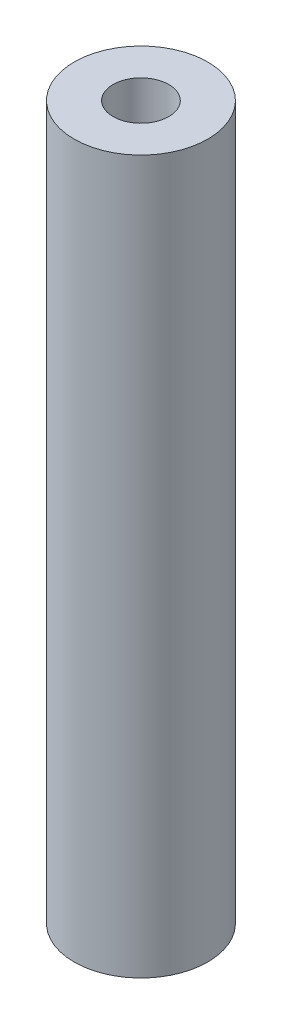
ISO-10303-21;
HEADER;
FILE_DESCRIPTION(('STEP AP214'),'2;1');
FILE_NAME('part.step','',(''),(''),'','','');
FILE_SCHEMA(('AUTOMOTIVE_DESIGN { 1 0 10303 214 1 1 1 1 }'));
ENDSEC;
DATA;
#1=APPLICATION_CONTEXT('core data for automotive mechanical design processes');
#2=APPLICATION_PROTOCOL_DEFINITION('international standard','automotive_design',2000,#1);
#3=PRODUCT_CONTEXT('',#1,'mechanical');
#4=PRODUCT('Part','Part','',(#3));
#5=PRODUCT_RELATED_PRODUCT_CATEGORY('part','',(#4));
#6=PRODUCT_DEFINITION_FORMATION('','',#4);
#7=PRODUCT_DEFINITION_CONTEXT('part definition',#1,'design');
#8=PRODUCT_DEFINITION('design','',#6,#7);
#9=PRODUCT_DEFINITION_SHAPE('','',#8);
#10=(LENGTH_UNIT() NAMED_UNIT(*) SI_UNIT(.MILLI.,.METRE.));
#11=(NAMED_UNIT(*) PLANE_ANGLE_UNIT() SI_UNIT($,.RADIAN.));
#12=(NAMED_UNIT(*) SI_UNIT($,.STERADIAN.) SOLID_ANGLE_UNIT());
#13=UNCERTAINTY_MEASURE_WITH_UNIT(LENGTH_MEASURE(1.E-05),#10,'distance_accuracy_value','');
#14=(GEOMETRIC_REPRESENTATION_CONTEXT(3) GLOBAL_UNCERTAINTY_ASSIGNED_CONTEXT((#13)) GLOBAL_UNIT_ASSIGNED_CONTEXT((#10,
#11,#12)) REPRESENTATION_CONTEXT('',''));
#15=CARTESIAN_POINT('',(0.,0.,0.));
#16=DIRECTION('',(0.,0.,1.));
#17=DIRECTION('',(1.,0.,0.));
#18=AXIS2_PLACEMENT_3D('',#15,#16,#17);
#19=CARTESIAN_POINT('',(0.,32.,0.));
#20=DIRECTION('',(0.,-1.,0.));
#21=DIRECTION('',(0.,0.,-1.));
#22=AXIS2_PLACEMENT_3D('',#19,#20,#21);
#23=CYLINDRICAL_SURFACE('',#22,3.);
#24=CARTESIAN_POINT('',(0.,32.,0.));
#25=DIRECTION('',(0.,1.,0.));
#26=DIRECTION('',(0.,0.,1.));
#27=AXIS2_PLACEMENT_3D('',#24,#25,#26);
#28=CIRCLE('',#27,3.);
#29=CARTESIAN_POINT('',(0.,32.,3.));
#30=VERTEX_POINT('',#29);
#31=EDGE_CURVE('E11',#30,#30,#28,.T.);
#32=ORIENTED_EDGE('',*,*,#31,.F.);
#33=EDGE_LOOP('',(#32));
#34=FACE_BOUND('',#33,.T.);
#35=CARTESIAN_POINT('',(0.,0.,0.));
#36=DIRECTION('',(0.,1.,0.));
#37=DIRECTION('',(0.,0.,1.));
#38=AXIS2_PLACEMENT_3D('',#35,#36,#37);
#39=CIRCLE('',#38,3.);
#40=CARTESIAN_POINT('',(0.,0.,3.));
#41=VERTEX_POINT('',#40);
#42=EDGE_CURVE('E36',#41,#41,#39,.T.);
#43=ORIENTED_EDGE('',*,*,#42,.T.);
#44=EDGE_LOOP('',(#43));
#45=FACE_BOUND('',#44,.T.);
#46=ADVANCED_FACE('F33',(#34,#45),#23,.T.);
#47=CARTESIAN_POINT('',(0.,32.,0.));
#48=DIRECTION('',(0.,1.,0.));
#49=DIRECTION('',(0.,0.,1.));
#50=AXIS2_PLACEMENT_3D('',#47,#48,#49);
#51=PLANE('',#50);
#52=CARTESIAN_POINT('',(0.,32.,0.));
#53=DIRECTION('',(0.,1.,0.));
#54=DIRECTION('',(0.,0.,1.));
#55=AXIS2_PLACEMENT_3D('',#52,#53,#54);
#56=CIRCLE('',#55,1.24999999999999);
#57=CARTESIAN_POINT('',(0.,32.,1.24999999999999));
#58=VERTEX_POINT('',#57);
#59=EDGE_CURVE('E56',#58,#58,#56,.T.);
#60=ORIENTED_EDGE('',*,*,#59,.F.);
#61=EDGE_LOOP('',(#60));
#62=FACE_BOUND('',#61,.T.);
#63=ORIENTED_EDGE('',*,*,#31,.T.);
#64=EDGE_LOOP('',(#63));
#65=FACE_BOUND('',#64,.T.);
#66=ADVANCED_FACE('F75',(#62,#65),#51,.T.);
#67=CARTESIAN_POINT('',(0.,0.,0.));
#68=DIRECTION('',(0.,1.,0.));
#69=DIRECTION('',(0.,0.,1.));
#70=AXIS2_PLACEMENT_3D('',#67,#68,#69);
#71=PLANE('',#70);
#72=CARTESIAN_POINT('',(0.,0.,0.));
#73=DIRECTION('',(0.,-1.,0.));
#74=DIRECTION('',(0.,0.,-1.));
#75=AXIS2_PLACEMENT_3D('',#72,#73,#74);
#76=CIRCLE('',#75,1.24999999999999);
#77=CARTESIAN_POINT('',(0.,0.,-1.24999999999999));
#78=VERTEX_POINT('',#77);
#79=EDGE_CURVE('E57',#78,#78,#76,.T.);
#80=ORIENTED_EDGE('',*,*,#79,.F.);
#81=EDGE_LOOP('',(#80));
#82=FACE_BOUND('',#81,.T.);
#83=ORIENTED_EDGE('',*,*,#42,.F.);
#84=EDGE_LOOP('',(#83));
#85=FACE_BOUND('',#84,.T.);
#86=ADVANCED_FACE('F72',(#82,#85),#71,.F.);
#87=CARTESIAN_POINT('',(0.,22.,0.));
#88=DIRECTION('',(0.,1.,0.));
#89=DIRECTION('',(0.,0.,1.));
#90=AXIS2_PLACEMENT_3D('',#87,#88,#89);
#91=CONICAL_SURFACE('',#90,1.25,1.02974425867665);
#92=CARTESIAN_POINT('',(0.,21.2489242262155,0.));
#93=VERTEX_POINT('',#92);
#94=VERTEX_LOOP('',#93);
#95=FACE_BOUND('',#94,.T.);
#96=CARTESIAN_POINT('',(0.,22.,0.));
#97=DIRECTION('',(0.,1.,0.));
#98=DIRECTION('',(0.,0.,1.));
#99=AXIS2_PLACEMENT_3D('',#96,#97,#98);
#100=CIRCLE('',#99,1.25);
#101=CARTESIAN_POINT('',(0.,22.,1.25));
#102=VERTEX_POINT('',#101);
#103=EDGE_CURVE('E60',#102,#102,#100,.T.);
#104=ORIENTED_EDGE('',*,*,#103,.T.);
#105=EDGE_LOOP('',(#104));
#106=FACE_BOUND('',#105,.T.);
#107=ADVANCED_FACE('F74',(#95,#106),#91,.F.);
#108=CARTESIAN_POINT('',(0.,32.,0.));
#109=DIRECTION('',(0.,1.,0.));
#110=DIRECTION('',(0.,0.,1.));
#111=AXIS2_PLACEMENT_3D('',#108,#109,#110);
#112=CYLINDRICAL_SURFACE('',#111,1.24999999999999);
#113=ORIENTED_EDGE('',*,*,#103,.F.);
#114=EDGE_LOOP('',(#113));
#115=FACE_BOUND('',#114,.T.);
#116=ORIENTED_EDGE('',*,*,#59,.T.);
#117=EDGE_LOOP('',(#116));
#118=FACE_BOUND('',#117,.T.);
#119=ADVANCED_FACE('F50',(#115,#118),#112,.F.);
#120=CARTESIAN_POINT('',(0.,9.99999999999999,0.));
#121=DIRECTION('',(0.,-1.,0.));
#122=DIRECTION('',(0.,0.,-1.));
#123=AXIS2_PLACEMENT_3D('',#120,#121,#122);
#124=CONICAL_SURFACE('',#123,1.24999999999999,1.02974425867665);
#125=CARTESIAN_POINT('',(0.,10.7510757737845,0.));
#126=VERTEX_POINT('',#125);
#127=VERTEX_LOOP('',#126);
#128=FACE_BOUND('',#127,.T.);
#129=CARTESIAN_POINT('',(0.,9.99999999999999,0.));
#130=DIRECTION('',(0.,-1.,0.));
#131=DIRECTION('',(0.,0.,-1.));
#132=AXIS2_PLACEMENT_3D('',#129,#130,#131);
#133=CIRCLE('',#132,1.24999999999999);
#134=CARTESIAN_POINT('',(0.,9.99999999999999,-1.24999999999999));
#135=VERTEX_POINT('',#134);
#136=EDGE_CURVE('E54',#135,#135,#133,.T.);
#137=ORIENTED_EDGE('',*,*,#136,.T.);
#138=EDGE_LOOP('',(#137));
#139=FACE_BOUND('',#138,.T.);
#140=ADVANCED_FACE('F46',(#128,#139),#124,.F.);
#141=CARTESIAN_POINT('',(0.,0.,0.));
#142=DIRECTION('',(0.,-1.,0.));
#143=DIRECTION('',(0.,0.,-1.));
#144=AXIS2_PLACEMENT_3D('',#141,#142,#143);
#145=CYLINDRICAL_SURFACE('',#144,1.24999999999999);
#146=ORIENTED_EDGE('',*,*,#136,.F.);
#147=EDGE_LOOP('',(#146));
#148=FACE_BOUND('',#147,.T.);
#149=ORIENTED_EDGE('',*,*,#79,.T.);
#150=EDGE_LOOP('',(#149));
#151=FACE_BOUND('',#150,.T.);
#152=ADVANCED_FACE('F49',(#148,#151),#145,.F.);
#153=CLOSED_SHELL('',(#46,#66,#86,#107,#119,#140,#152));
#154=MANIFOLD_SOLID_BREP('B2',#153);
#155=ADVANCED_BREP_SHAPE_REPRESENTATION('',(#18,#154),#14);
#156=SHAPE_DEFINITION_REPRESENTATION(#9,#155);
ENDSEC;
END-ISO-10303-21;
